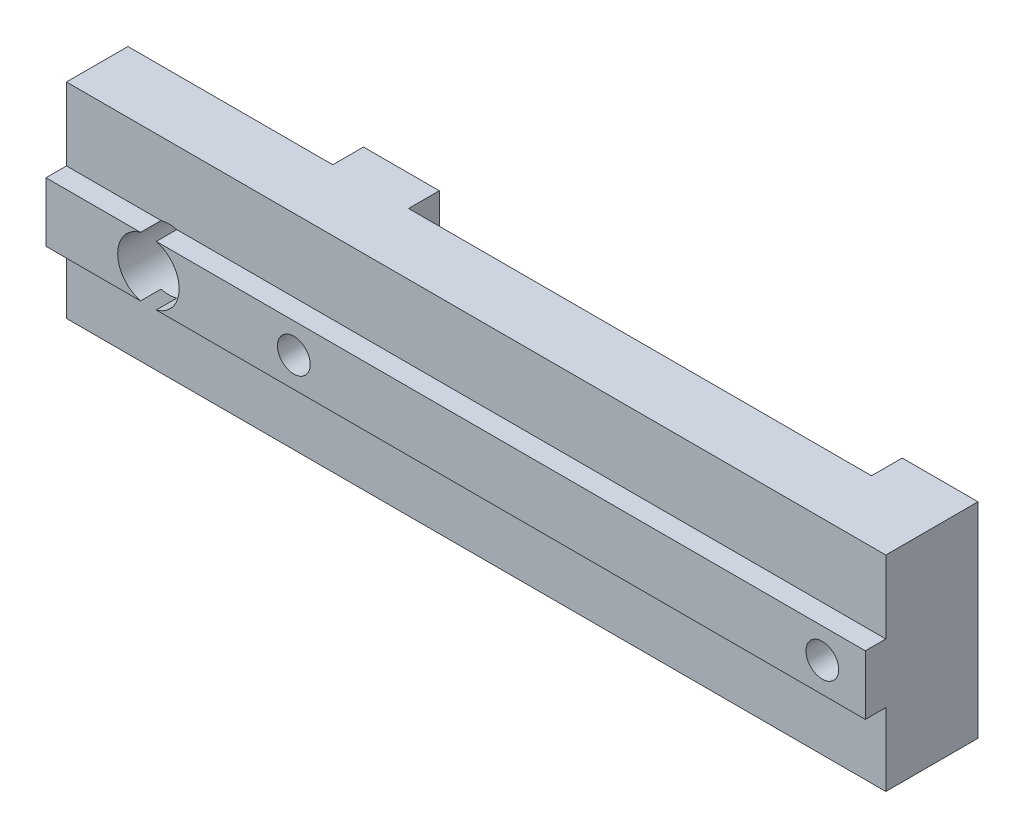
ISO-10303-21;
HEADER;
FILE_DESCRIPTION(('STEP AP214'),'2;1');
FILE_NAME('part.step','',(''),(''),'','','');
FILE_SCHEMA(('AUTOMOTIVE_DESIGN { 1 0 10303 214 1 1 1 1 }'));
ENDSEC;
DATA;
#1=APPLICATION_CONTEXT('core data for automotive mechanical design processes');
#2=APPLICATION_PROTOCOL_DEFINITION('international standard','automotive_design',2000,#1);
#3=PRODUCT_CONTEXT('',#1,'mechanical');
#4=PRODUCT('Part','Part','',(#3));
#5=PRODUCT_RELATED_PRODUCT_CATEGORY('part','',(#4));
#6=PRODUCT_DEFINITION_FORMATION('','',#4);
#7=PRODUCT_DEFINITION_CONTEXT('part definition',#1,'design');
#8=PRODUCT_DEFINITION('design','',#6,#7);
#9=PRODUCT_DEFINITION_SHAPE('','',#8);
#10=(LENGTH_UNIT() NAMED_UNIT(*) SI_UNIT(.MILLI.,.METRE.));
#11=(NAMED_UNIT(*) PLANE_ANGLE_UNIT() SI_UNIT($,.RADIAN.));
#12=(NAMED_UNIT(*) SI_UNIT($,.STERADIAN.) SOLID_ANGLE_UNIT());
#13=UNCERTAINTY_MEASURE_WITH_UNIT(LENGTH_MEASURE(1.E-05),#10,'distance_accuracy_value','');
#14=(GEOMETRIC_REPRESENTATION_CONTEXT(3) GLOBAL_UNCERTAINTY_ASSIGNED_CONTEXT((#13)) GLOBAL_UNIT_ASSIGNED_CONTEXT((#10,
#11,#12)) REPRESENTATION_CONTEXT('',''));
#15=CARTESIAN_POINT('',(0.,0.,0.));
#16=DIRECTION('',(0.,0.,1.));
#17=DIRECTION('',(1.,0.,0.));
#18=AXIS2_PLACEMENT_3D('',#15,#16,#17);
#19=CARTESIAN_POINT('',(0.,0.,0.));
#20=DIRECTION('',(0.,0.,-1.));
#21=DIRECTION('',(-1.,0.,0.));
#22=AXIS2_PLACEMENT_3D('',#19,#20,#21);
#23=PLANE('',#22);
#24=DIRECTION('',(-1.,0.,0.));
#25=VECTOR('',#24,1.);
#26=CARTESIAN_POINT('',(0.,10.,0.));
#27=LINE('',#26,#25);
#28=CARTESIAN_POINT('',(36.3,10.,0.));
#29=VERTEX_POINT('',#28);
#30=CARTESIAN_POINT('',(13.7,10.,0.));
#31=VERTEX_POINT('',#30);
#32=EDGE_CURVE('E295',#29,#31,#27,.T.);
#33=ORIENTED_EDGE('',*,*,#32,.F.);
#34=DIRECTION('',(0.,1.,0.));
#35=VECTOR('',#34,1.);
#36=CARTESIAN_POINT('',(36.3,0.,0.));
#37=LINE('',#36,#35);
#38=CARTESIAN_POINT('',(36.3,0.,0.));
#39=VERTEX_POINT('',#38);
#40=EDGE_CURVE('E187',#39,#29,#37,.T.);
#41=ORIENTED_EDGE('',*,*,#40,.F.);
#42=DIRECTION('',(1.,0.,0.));
#43=VECTOR('',#42,1.);
#44=CARTESIAN_POINT('',(0.,0.,0.));
#45=LINE('',#44,#43);
#46=CARTESIAN_POINT('',(13.7,0.,0.));
#47=VERTEX_POINT('',#46);
#48=EDGE_CURVE('E291',#47,#39,#45,.T.);
#49=ORIENTED_EDGE('',*,*,#48,.F.);
#50=DIRECTION('',(0.,-1.,0.));
#51=VECTOR('',#50,1.);
#52=CARTESIAN_POINT('',(13.7,0.,0.));
#53=LINE('',#52,#51);
#54=EDGE_CURVE('E203',#31,#47,#53,.T.);
#55=ORIENTED_EDGE('',*,*,#54,.F.);
#56=EDGE_LOOP('',(#33,#41,#49,#55));
#57=FACE_BOUND('',#56,.T.);
#58=ADVANCED_FACE('F35',(#57),#23,.T.);
#59=DIRECTION('',(0.,1.,0.));
#60=VECTOR('',#59,1.);
#61=CARTESIAN_POINT('',(10.,0.,0.));
#62=LINE('',#61,#60);
#63=CARTESIAN_POINT('',(10.,0.,0.));
#64=VERTEX_POINT('',#63);
#65=CARTESIAN_POINT('',(10.,10.,0.));
#66=VERTEX_POINT('',#65);
#67=EDGE_CURVE('E58',#64,#66,#62,.T.);
#68=ORIENTED_EDGE('',*,*,#67,.F.);
#69=CARTESIAN_POINT('',(0.,0.,0.));
#70=VERTEX_POINT('',#69);
#71=EDGE_CURVE('E292',#70,#64,#45,.T.);
#72=ORIENTED_EDGE('',*,*,#71,.F.);
#73=DIRECTION('',(0.,-1.,0.));
#74=VECTOR('',#73,1.);
#75=CARTESIAN_POINT('',(0.,0.,0.));
#76=LINE('',#75,#74);
#77=CARTESIAN_POINT('',(0.,10.,0.));
#78=VERTEX_POINT('',#77);
#79=EDGE_CURVE('E277',#78,#70,#76,.T.);
#80=ORIENTED_EDGE('',*,*,#79,.F.);
#81=EDGE_CURVE('E294',#66,#78,#27,.T.);
#82=ORIENTED_EDGE('',*,*,#81,.F.);
#83=EDGE_LOOP('',(#68,#72,#80,#82));
#84=FACE_BOUND('',#83,.T.);
#85=CARTESIAN_POINT('',(5.,5.,0.));
#86=DIRECTION('',(0.,0.,-1.));
#87=DIRECTION('',(-1.,0.,0.));
#88=AXIS2_PLACEMENT_3D('',#85,#86,#87);
#89=CIRCLE('',#88,1.5);
#90=CARTESIAN_POINT('',(3.5,5.,0.));
#91=VERTEX_POINT('',#90);
#92=EDGE_CURVE('E224',#91,#91,#89,.T.);
#93=ORIENTED_EDGE('',*,*,#92,.F.);
#94=EDGE_LOOP('',(#93));
#95=FACE_BOUND('',#94,.T.);
#96=ADVANCED_FACE('F337',(#84,#95),#23,.T.);
#97=CARTESIAN_POINT('',(40.,6.45000000000001,4.));
#98=DIRECTION('',(0.,-1.,0.));
#99=DIRECTION('',(1.,0.,0.));
#100=AXIS2_PLACEMENT_3D('',#97,#98,#99);
#101=PLANE('',#100);
#102=DIRECTION('',(-1.,0.,0.));
#103=VECTOR('',#102,1.);
#104=CARTESIAN_POINT('',(40.,6.45000000000001,4.));
#105=LINE('',#104,#103);
#106=CARTESIAN_POINT('',(4.61594271260656,6.45,4.));
#107=VERTEX_POINT('',#106);
#108=CARTESIAN_POINT('',(0.,6.45,4.));
#109=VERTEX_POINT('',#108);
#110=EDGE_CURVE('E249',#107,#109,#105,.T.);
#111=ORIENTED_EDGE('',*,*,#110,.F.);
#112=DIRECTION('',(0.,0.,-1.));
#113=VECTOR('',#112,1.);
#114=CARTESIAN_POINT('',(4.61594271260656,6.45,4.));
#115=LINE('',#114,#113);
#116=CARTESIAN_POINT('',(4.61594271260656,6.45,3.));
#117=VERTEX_POINT('',#116);
#118=EDGE_CURVE('E242',#107,#117,#115,.T.);
#119=ORIENTED_EDGE('',*,*,#118,.T.);
#120=DIRECTION('',(-1.,0.,0.));
#121=VECTOR('',#120,1.);
#122=CARTESIAN_POINT('',(40.,6.45000000000001,3.));
#123=LINE('',#122,#121);
#124=CARTESIAN_POINT('',(0.,6.45,3.));
#125=VERTEX_POINT('',#124);
#126=EDGE_CURVE('E245',#117,#125,#123,.T.);
#127=ORIENTED_EDGE('',*,*,#126,.T.);
#128=DIRECTION('',(0.,0.,-1.));
#129=VECTOR('',#128,1.);
#130=CARTESIAN_POINT('',(0.,6.45,4.));
#131=LINE('',#130,#129);
#132=EDGE_CURVE('E271',#109,#125,#131,.T.);
#133=ORIENTED_EDGE('',*,*,#132,.F.);
#134=EDGE_LOOP('',(#111,#119,#127,#133));
#135=FACE_BOUND('',#134,.T.);
#136=ADVANCED_FACE('F321',(#135),#101,.F.);
#137=CARTESIAN_POINT('',(40.,3.55000000000001,4.));
#138=DIRECTION('',(0.,1.,0.));
#139=DIRECTION('',(-1.,0.,0.));
#140=AXIS2_PLACEMENT_3D('',#137,#138,#139);
#141=PLANE('',#140);
#142=DIRECTION('',(1.,0.,0.));
#143=VECTOR('',#142,1.);
#144=CARTESIAN_POINT('',(40.,3.55000000000001,4.));
#145=LINE('',#144,#143);
#146=CARTESIAN_POINT('',(5.38405728739345,3.55,4.));
#147=VERTEX_POINT('',#146);
#148=CARTESIAN_POINT('',(40.,3.55000000000001,4.));
#149=VERTEX_POINT('',#148);
#150=EDGE_CURVE('E256',#147,#149,#145,.T.);
#151=ORIENTED_EDGE('',*,*,#150,.F.);
#152=DIRECTION('',(0.,0.,-1.));
#153=VECTOR('',#152,1.);
#154=CARTESIAN_POINT('',(5.38405728739345,3.55,4.));
#155=LINE('',#154,#153);
#156=CARTESIAN_POINT('',(5.38405728739345,3.55,3.));
#157=VERTEX_POINT('',#156);
#158=EDGE_CURVE('E233',#147,#157,#155,.T.);
#159=ORIENTED_EDGE('',*,*,#158,.T.);
#160=DIRECTION('',(1.,0.,0.));
#161=VECTOR('',#160,1.);
#162=CARTESIAN_POINT('',(40.,3.55000000000001,3.));
#163=LINE('',#162,#161);
#164=CARTESIAN_POINT('',(40.,3.55,3.));
#165=VERTEX_POINT('',#164);
#166=EDGE_CURVE('E264',#157,#165,#163,.T.);
#167=ORIENTED_EDGE('',*,*,#166,.T.);
#168=DIRECTION('',(0.,0.,-1.));
#169=VECTOR('',#168,1.);
#170=CARTESIAN_POINT('',(40.,3.55000000000001,4.));
#171=LINE('',#170,#169);
#172=EDGE_CURVE('E260',#149,#165,#171,.T.);
#173=ORIENTED_EDGE('',*,*,#172,.F.);
#174=EDGE_LOOP('',(#151,#159,#167,#173));
#175=FACE_BOUND('',#174,.T.);
#176=ADVANCED_FACE('F377',(#175),#141,.F.);
#177=CARTESIAN_POINT('',(0.,0.,4.));
#178=DIRECTION('',(0.,0.,1.));
#179=DIRECTION('',(1.,0.,0.));
#180=AXIS2_PLACEMENT_3D('',#177,#178,#179);
#181=PLANE('',#180);
#182=CARTESIAN_POINT('',(5.,5.,4.));
#183=DIRECTION('',(0.,0.,1.));
#184=DIRECTION('',(1.,0.,0.));
#185=AXIS2_PLACEMENT_3D('',#182,#183,#184);
#186=CIRCLE('',#185,1.5);
#187=CARTESIAN_POINT('',(4.61594271260655,3.55,4.));
#188=VERTEX_POINT('',#187);
#189=EDGE_CURVE('E11',#107,#188,#186,.T.);
#190=ORIENTED_EDGE('',*,*,#189,.F.);
#191=ORIENTED_EDGE('',*,*,#110,.T.);
#192=DIRECTION('',(0.,-1.,0.));
#193=VECTOR('',#192,1.);
#194=CARTESIAN_POINT('',(0.,3.55,4.));
#195=LINE('',#194,#193);
#196=CARTESIAN_POINT('',(0.,3.55,4.));
#197=VERTEX_POINT('',#196);
#198=EDGE_CURVE('E254',#109,#197,#195,.T.);
#199=ORIENTED_EDGE('',*,*,#198,.T.);
#200=EDGE_CURVE('E257',#197,#188,#145,.T.);
#201=ORIENTED_EDGE('',*,*,#200,.T.);
#202=EDGE_LOOP('',(#190,#191,#199,#201));
#203=FACE_BOUND('',#202,.T.);
#204=ADVANCED_FACE('F325',(#203),#181,.T.);
#205=CARTESIAN_POINT('',(0.,0.,3.));
#206=DIRECTION('',(0.,0.,-1.));
#207=DIRECTION('',(-1.,0.,0.));
#208=AXIS2_PLACEMENT_3D('',#205,#206,#207);
#209=PLANE('',#208);
#210=ORIENTED_EDGE('',*,*,#166,.F.);
#211=CARTESIAN_POINT('',(5.,5.,3.));
#212=DIRECTION('',(0.,0.,-1.));
#213=DIRECTION('',(-1.,0.,0.));
#214=AXIS2_PLACEMENT_3D('',#211,#212,#213);
#215=CIRCLE('',#214,1.5);
#216=CARTESIAN_POINT('',(4.61594271260655,3.55,3.));
#217=VERTEX_POINT('',#216);
#218=EDGE_CURVE('E230',#157,#217,#215,.T.);
#219=ORIENTED_EDGE('',*,*,#218,.T.);
#220=CARTESIAN_POINT('',(0.,3.55,3.));
#221=VERTEX_POINT('',#220);
#222=EDGE_CURVE('E250',#221,#217,#163,.T.);
#223=ORIENTED_EDGE('',*,*,#222,.F.);
#224=DIRECTION('',(0.,-1.,0.));
#225=VECTOR('',#224,1.);
#226=CARTESIAN_POINT('',(0.,0.,3.));
#227=LINE('',#226,#225);
#228=CARTESIAN_POINT('',(0.,0.,3.));
#229=VERTEX_POINT('',#228);
#230=EDGE_CURVE('E282',#221,#229,#227,.T.);
#231=ORIENTED_EDGE('',*,*,#230,.T.);
#232=DIRECTION('',(1.,0.,0.));
#233=VECTOR('',#232,1.);
#234=CARTESIAN_POINT('',(0.,0.,3.));
#235=LINE('',#234,#233);
#236=CARTESIAN_POINT('',(40.,0.,3.));
#237=VERTEX_POINT('',#236);
#238=EDGE_CURVE('E281',#229,#237,#235,.T.);
#239=ORIENTED_EDGE('',*,*,#238,.T.);
#240=DIRECTION('',(0.,1.,0.));
#241=VECTOR('',#240,1.);
#242=CARTESIAN_POINT('',(40.,0.,3.));
#243=LINE('',#242,#241);
#244=EDGE_CURVE('E169',#237,#165,#243,.T.);
#245=ORIENTED_EDGE('',*,*,#244,.T.);
#246=EDGE_LOOP('',(#210,#219,#223,#231,#239,#245));
#247=FACE_BOUND('',#246,.T.);
#248=ADVANCED_FACE('F333',(#247),#209,.F.);
#249=ORIENTED_EDGE('',*,*,#126,.F.);
#250=CARTESIAN_POINT('',(5.,5.,3.));
#251=DIRECTION('',(0.,0.,-1.));
#252=DIRECTION('',(-1.,0.,0.));
#253=AXIS2_PLACEMENT_3D('',#250,#251,#252);
#254=CIRCLE('',#253,1.5);
#255=CARTESIAN_POINT('',(5.38405728739344,6.45,3.));
#256=VERTEX_POINT('',#255);
#257=EDGE_CURVE('E239',#117,#256,#254,.T.);
#258=ORIENTED_EDGE('',*,*,#257,.T.);
#259=CARTESIAN_POINT('',(40.,6.45,3.));
#260=VERTEX_POINT('',#259);
#261=EDGE_CURVE('E261',#260,#256,#123,.T.);
#262=ORIENTED_EDGE('',*,*,#261,.F.);
#263=CARTESIAN_POINT('',(40.,10.,3.));
#264=VERTEX_POINT('',#263);
#265=EDGE_CURVE('E284',#260,#264,#243,.T.);
#266=ORIENTED_EDGE('',*,*,#265,.T.);
#267=DIRECTION('',(-1.,0.,0.));
#268=VECTOR('',#267,1.);
#269=CARTESIAN_POINT('',(0.,10.,3.));
#270=LINE('',#269,#268);
#271=CARTESIAN_POINT('',(0.,10.,3.));
#272=VERTEX_POINT('',#271);
#273=EDGE_CURVE('E286',#264,#272,#270,.T.);
#274=ORIENTED_EDGE('',*,*,#273,.T.);
#275=EDGE_CURVE('E278',#272,#125,#227,.T.);
#276=ORIENTED_EDGE('',*,*,#275,.T.);
#277=EDGE_LOOP('',(#249,#258,#262,#266,#274,#276));
#278=FACE_BOUND('',#277,.T.);
#279=ADVANCED_FACE('F316',(#278),#209,.F.);
#280=CARTESIAN_POINT('',(0.,0.,3.));
#281=DIRECTION('',(1.,0.,0.));
#282=DIRECTION('',(0.,0.,-1.));
#283=AXIS2_PLACEMENT_3D('',#280,#281,#282);
#284=PLANE('',#283);
#285=ORIENTED_EDGE('',*,*,#79,.T.);
#286=DIRECTION('',(0.,0.,-1.));
#287=VECTOR('',#286,1.);
#288=CARTESIAN_POINT('',(0.,0.,3.));
#289=LINE('',#288,#287);
#290=EDGE_CURVE('E172',#229,#70,#289,.T.);
#291=ORIENTED_EDGE('',*,*,#290,.F.);
#292=ORIENTED_EDGE('',*,*,#230,.F.);
#293=DIRECTION('',(0.,0.,-1.));
#294=VECTOR('',#293,1.);
#295=CARTESIAN_POINT('',(0.,3.55,4.));
#296=LINE('',#295,#294);
#297=EDGE_CURVE('E268',#197,#221,#296,.T.);
#298=ORIENTED_EDGE('',*,*,#297,.F.);
#299=ORIENTED_EDGE('',*,*,#198,.F.);
#300=ORIENTED_EDGE('',*,*,#132,.T.);
#301=ORIENTED_EDGE('',*,*,#275,.F.);
#302=DIRECTION('',(0.,0.,-1.));
#303=VECTOR('',#302,1.);
#304=CARTESIAN_POINT('',(0.,10.,3.));
#305=LINE('',#304,#303);
#306=EDGE_CURVE('E288',#272,#78,#305,.T.);
#307=ORIENTED_EDGE('',*,*,#306,.T.);
#308=EDGE_LOOP('',(#285,#291,#292,#298,#299,#300,#301,#307));
#309=FACE_BOUND('',#308,.T.);
#310=ADVANCED_FACE('F37',(#309),#284,.F.);
#311=CARTESIAN_POINT('',(0.,0.,3.));
#312=DIRECTION('',(0.,1.,0.));
#313=DIRECTION('',(0.,0.,1.));
#314=AXIS2_PLACEMENT_3D('',#311,#312,#313);
#315=PLANE('',#314);
#316=ORIENTED_EDGE('',*,*,#71,.T.);
#317=DIRECTION('',(0.,0.,1.));
#318=VECTOR('',#317,1.);
#319=CARTESIAN_POINT('',(10.,0.,-1.5));
#320=LINE('',#319,#318);
#321=CARTESIAN_POINT('',(10.,0.,-1.5));
#322=VERTEX_POINT('',#321);
#323=EDGE_CURVE('E209',#322,#64,#320,.T.);
#324=ORIENTED_EDGE('',*,*,#323,.F.);
#325=DIRECTION('',(-1.,0.,0.));
#326=VECTOR('',#325,1.);
#327=CARTESIAN_POINT('',(10.,0.,-1.5));
#328=LINE('',#327,#326);
#329=CARTESIAN_POINT('',(13.7,0.,-1.5));
#330=VERTEX_POINT('',#329);
#331=EDGE_CURVE('E207',#330,#322,#328,.T.);
#332=ORIENTED_EDGE('',*,*,#331,.F.);
#333=DIRECTION('',(0.,0.,1.));
#334=VECTOR('',#333,1.);
#335=CARTESIAN_POINT('',(13.7,0.,-1.5));
#336=LINE('',#335,#334);
#337=EDGE_CURVE('E215',#330,#47,#336,.T.);
#338=ORIENTED_EDGE('',*,*,#337,.T.);
#339=ORIENTED_EDGE('',*,*,#48,.T.);
#340=DIRECTION('',(0.,0.,1.));
#341=VECTOR('',#340,1.);
#342=CARTESIAN_POINT('',(36.3,0.,-1.5));
#343=LINE('',#342,#341);
#344=CARTESIAN_POINT('',(36.3,0.,-1.5));
#345=VERTEX_POINT('',#344);
#346=EDGE_CURVE('E179',#345,#39,#343,.T.);
#347=ORIENTED_EDGE('',*,*,#346,.F.);
#348=DIRECTION('',(-1.,0.,0.));
#349=VECTOR('',#348,1.);
#350=CARTESIAN_POINT('',(40.,0.,-1.5));
#351=LINE('',#350,#349);
#352=CARTESIAN_POINT('',(40.,0.,-1.5));
#353=VERTEX_POINT('',#352);
#354=EDGE_CURVE('E176',#353,#345,#351,.T.);
#355=ORIENTED_EDGE('',*,*,#354,.F.);
#356=DIRECTION('',(0.,0.,-1.));
#357=VECTOR('',#356,1.);
#358=CARTESIAN_POINT('',(40.,0.,3.));
#359=LINE('',#358,#357);
#360=EDGE_CURVE('E161',#237,#353,#359,.T.);
#361=ORIENTED_EDGE('',*,*,#360,.F.);
#362=ORIENTED_EDGE('',*,*,#238,.F.);
#363=ORIENTED_EDGE('',*,*,#290,.T.);
#364=EDGE_LOOP('',(#316,#324,#332,#338,#339,#347,#355,#361,#362,#363));
#365=FACE_BOUND('',#364,.T.);
#366=ADVANCED_FACE('F177',(#365),#315,.F.);
#367=CARTESIAN_POINT('',(40.,0.,3.));
#368=DIRECTION('',(-1.,0.,0.));
#369=DIRECTION('',(0.,0.,1.));
#370=AXIS2_PLACEMENT_3D('',#367,#368,#369);
#371=PLANE('',#370);
#372=ORIENTED_EDGE('',*,*,#360,.T.);
#373=DIRECTION('',(0.,-1.,0.));
#374=VECTOR('',#373,1.);
#375=CARTESIAN_POINT('',(40.,0.,-1.5));
#376=LINE('',#375,#374);
#377=CARTESIAN_POINT('',(40.,10.,-1.5));
#378=VERTEX_POINT('',#377);
#379=EDGE_CURVE('E166',#378,#353,#376,.T.);
#380=ORIENTED_EDGE('',*,*,#379,.F.);
#381=DIRECTION('',(0.,0.,-1.));
#382=VECTOR('',#381,1.);
#383=CARTESIAN_POINT('',(40.,10.,3.));
#384=LINE('',#383,#382);
#385=EDGE_CURVE('E173',#264,#378,#384,.T.);
#386=ORIENTED_EDGE('',*,*,#385,.F.);
#387=ORIENTED_EDGE('',*,*,#265,.F.);
#388=DIRECTION('',(0.,0.,-1.));
#389=VECTOR('',#388,1.);
#390=CARTESIAN_POINT('',(40.,6.45000000000001,4.));
#391=LINE('',#390,#389);
#392=CARTESIAN_POINT('',(40.,6.45000000000001,4.));
#393=VERTEX_POINT('',#392);
#394=EDGE_CURVE('E274',#393,#260,#391,.T.);
#395=ORIENTED_EDGE('',*,*,#394,.F.);
#396=DIRECTION('',(0.,1.,0.));
#397=VECTOR('',#396,1.);
#398=CARTESIAN_POINT('',(40.,3.55000000000001,4.));
#399=LINE('',#398,#397);
#400=EDGE_CURVE('E246',#149,#393,#399,.T.);
#401=ORIENTED_EDGE('',*,*,#400,.F.);
#402=ORIENTED_EDGE('',*,*,#172,.T.);
#403=ORIENTED_EDGE('',*,*,#244,.F.);
#404=EDGE_LOOP('',(#372,#380,#386,#387,#395,#401,#402,#403));
#405=FACE_BOUND('',#404,.T.);
#406=ADVANCED_FACE('F163',(#405),#371,.F.);
#407=CARTESIAN_POINT('',(0.,10.,3.));
#408=DIRECTION('',(0.,-1.,0.));
#409=DIRECTION('',(0.,0.,-1.));
#410=AXIS2_PLACEMENT_3D('',#407,#408,#409);
#411=PLANE('',#410);
#412=ORIENTED_EDGE('',*,*,#385,.T.);
#413=DIRECTION('',(1.,0.,0.));
#414=VECTOR('',#413,1.);
#415=CARTESIAN_POINT('',(40.,10.,-1.5));
#416=LINE('',#415,#414);
#417=CARTESIAN_POINT('',(36.3,10.,-1.5));
#418=VERTEX_POINT('',#417);
#419=EDGE_CURVE('E186',#418,#378,#416,.T.);
#420=ORIENTED_EDGE('',*,*,#419,.F.);
#421=DIRECTION('',(0.,0.,1.));
#422=VECTOR('',#421,1.);
#423=CARTESIAN_POINT('',(36.3,10.,-1.5));
#424=LINE('',#423,#422);
#425=EDGE_CURVE('E50',#418,#29,#424,.T.);
#426=ORIENTED_EDGE('',*,*,#425,.T.);
#427=ORIENTED_EDGE('',*,*,#32,.T.);
#428=DIRECTION('',(0.,0.,1.));
#429=VECTOR('',#428,1.);
#430=CARTESIAN_POINT('',(13.7,10.,-1.5));
#431=LINE('',#430,#429);
#432=CARTESIAN_POINT('',(13.7,10.,-1.5));
#433=VERTEX_POINT('',#432);
#434=EDGE_CURVE('E218',#433,#31,#431,.T.);
#435=ORIENTED_EDGE('',*,*,#434,.F.);
#436=DIRECTION('',(1.,0.,0.));
#437=VECTOR('',#436,1.);
#438=CARTESIAN_POINT('',(10.,10.,-1.5));
#439=LINE('',#438,#437);
#440=CARTESIAN_POINT('',(10.,10.,-1.5));
#441=VERTEX_POINT('',#440);
#442=EDGE_CURVE('E202',#441,#433,#439,.T.);
#443=ORIENTED_EDGE('',*,*,#442,.F.);
#444=DIRECTION('',(0.,0.,1.));
#445=VECTOR('',#444,1.);
#446=CARTESIAN_POINT('',(10.,10.,-1.5));
#447=LINE('',#446,#445);
#448=EDGE_CURVE('E221',#441,#66,#447,.T.);
#449=ORIENTED_EDGE('',*,*,#448,.T.);
#450=ORIENTED_EDGE('',*,*,#81,.T.);
#451=ORIENTED_EDGE('',*,*,#306,.F.);
#452=ORIENTED_EDGE('',*,*,#273,.F.);
#453=EDGE_LOOP('',(#412,#420,#426,#427,#435,#443,#449,#450,#451,#452));
#454=FACE_BOUND('',#453,.T.);
#455=ADVANCED_FACE('F358',(#454),#411,.F.);
#456=ORIENTED_EDGE('',*,*,#261,.T.);
#457=DIRECTION('',(0.,0.,-1.));
#458=VECTOR('',#457,1.);
#459=CARTESIAN_POINT('',(5.38405728739344,6.45,4.));
#460=LINE('',#459,#458);
#461=CARTESIAN_POINT('',(5.38405728739344,6.45,4.));
#462=VERTEX_POINT('',#461);
#463=EDGE_CURVE('E236',#256,#462,#460,.F.);
#464=ORIENTED_EDGE('',*,*,#463,.T.);
#465=EDGE_CURVE('E251',#393,#462,#105,.T.);
#466=ORIENTED_EDGE('',*,*,#465,.F.);
#467=ORIENTED_EDGE('',*,*,#394,.T.);
#468=EDGE_LOOP('',(#456,#464,#466,#467));
#469=FACE_BOUND('',#468,.T.);
#470=ADVANCED_FACE('F307',(#469),#101,.F.);
#471=ORIENTED_EDGE('',*,*,#222,.T.);
#472=DIRECTION('',(0.,0.,-1.));
#473=VECTOR('',#472,1.);
#474=CARTESIAN_POINT('',(4.61594271260655,3.55,4.));
#475=LINE('',#474,#473);
#476=EDGE_CURVE('E227',#217,#188,#475,.F.);
#477=ORIENTED_EDGE('',*,*,#476,.T.);
#478=ORIENTED_EDGE('',*,*,#200,.F.);
#479=ORIENTED_EDGE('',*,*,#297,.T.);
#480=EDGE_LOOP('',(#471,#477,#478,#479));
#481=FACE_BOUND('',#480,.T.);
#482=ADVANCED_FACE('F329',(#481),#141,.F.);
#483=CARTESIAN_POINT('',(12.1,5.,4.));
#484=DIRECTION('',(0.,0.,-1.));
#485=DIRECTION('',(-1.,0.,0.));
#486=AXIS2_PLACEMENT_3D('',#483,#484,#485);
#487=CIRCLE('',#486,0.800000000000001);
#488=CARTESIAN_POINT('',(11.3,5.,4.));
#489=VERTEX_POINT('',#488);
#490=EDGE_CURVE('E408',#489,#489,#487,.T.);
#491=ORIENTED_EDGE('',*,*,#490,.T.);
#492=EDGE_LOOP('',(#491));
#493=FACE_BOUND('',#492,.T.);
#494=CARTESIAN_POINT('',(37.9,5.,4.));
#495=DIRECTION('',(0.,0.,-1.));
#496=DIRECTION('',(-1.,0.,0.));
#497=AXIS2_PLACEMENT_3D('',#494,#495,#496);
#498=CIRCLE('',#497,0.800000000000002);
#499=CARTESIAN_POINT('',(37.1,5.,4.));
#500=VERTEX_POINT('',#499);
#501=EDGE_CURVE('E189',#500,#500,#498,.T.);
#502=ORIENTED_EDGE('',*,*,#501,.T.);
#503=EDGE_LOOP('',(#502));
#504=FACE_BOUND('',#503,.T.);
#505=EDGE_CURVE('E39',#147,#462,#186,.T.);
#506=ORIENTED_EDGE('',*,*,#505,.F.);
#507=ORIENTED_EDGE('',*,*,#150,.T.);
#508=ORIENTED_EDGE('',*,*,#400,.T.);
#509=ORIENTED_EDGE('',*,*,#465,.T.);
#510=EDGE_LOOP('',(#506,#507,#508,#509));
#511=FACE_BOUND('',#510,.T.);
#512=ADVANCED_FACE('F308',(#493,#504,#511),#181,.T.);
#513=CARTESIAN_POINT('',(5.,5.,4.));
#514=DIRECTION('',(0.,0.,-1.));
#515=DIRECTION('',(-1.,0.,0.));
#516=AXIS2_PLACEMENT_3D('',#513,#514,#515);
#517=CYLINDRICAL_SURFACE('',#516,1.5);
#518=ORIENTED_EDGE('',*,*,#92,.T.);
#519=EDGE_LOOP('',(#518));
#520=FACE_BOUND('',#519,.T.);
#521=ORIENTED_EDGE('',*,*,#189,.T.);
#522=ORIENTED_EDGE('',*,*,#476,.F.);
#523=ORIENTED_EDGE('',*,*,#218,.F.);
#524=ORIENTED_EDGE('',*,*,#158,.F.);
#525=ORIENTED_EDGE('',*,*,#505,.T.);
#526=ORIENTED_EDGE('',*,*,#463,.F.);
#527=ORIENTED_EDGE('',*,*,#257,.F.);
#528=ORIENTED_EDGE('',*,*,#118,.F.);
#529=EDGE_LOOP('',(#521,#522,#523,#524,#525,#526,#527,#528));
#530=FACE_BOUND('',#529,.T.);
#531=ADVANCED_FACE('F303',(#520,#530),#517,.F.);
#532=CARTESIAN_POINT('',(10.,0.,-1.5));
#533=DIRECTION('',(1.,0.,0.));
#534=DIRECTION('',(0.,0.,-1.));
#535=AXIS2_PLACEMENT_3D('',#532,#533,#534);
#536=PLANE('',#535);
#537=ORIENTED_EDGE('',*,*,#67,.T.);
#538=ORIENTED_EDGE('',*,*,#448,.F.);
#539=DIRECTION('',(0.,1.,0.));
#540=VECTOR('',#539,1.);
#541=CARTESIAN_POINT('',(10.,0.,-1.5));
#542=LINE('',#541,#540);
#543=EDGE_CURVE('E199',#322,#441,#542,.T.);
#544=ORIENTED_EDGE('',*,*,#543,.F.);
#545=ORIENTED_EDGE('',*,*,#323,.T.);
#546=EDGE_LOOP('',(#537,#538,#544,#545));
#547=FACE_BOUND('',#546,.T.);
#548=ADVANCED_FACE('F343',(#547),#536,.F.);
#549=CARTESIAN_POINT('',(13.7,0.,-1.5));
#550=DIRECTION('',(-1.,0.,0.));
#551=DIRECTION('',(0.,-1.,0.));
#552=AXIS2_PLACEMENT_3D('',#549,#550,#551);
#553=PLANE('',#552);
#554=ORIENTED_EDGE('',*,*,#54,.T.);
#555=ORIENTED_EDGE('',*,*,#337,.F.);
#556=DIRECTION('',(0.,-1.,0.));
#557=VECTOR('',#556,1.);
#558=CARTESIAN_POINT('',(13.7,0.,-1.5));
#559=LINE('',#558,#557);
#560=EDGE_CURVE('E205',#433,#330,#559,.T.);
#561=ORIENTED_EDGE('',*,*,#560,.F.);
#562=ORIENTED_EDGE('',*,*,#434,.T.);
#563=EDGE_LOOP('',(#554,#555,#561,#562));
#564=FACE_BOUND('',#563,.T.);
#565=ADVANCED_FACE('F351',(#564),#553,.F.);
#566=CARTESIAN_POINT('',(0.,0.,-1.5));
#567=DIRECTION('',(0.,0.,-1.));
#568=DIRECTION('',(-1.,0.,0.));
#569=AXIS2_PLACEMENT_3D('',#566,#567,#568);
#570=PLANE('',#569);
#571=CARTESIAN_POINT('',(12.1,5.,-1.5));
#572=DIRECTION('',(0.,0.,-1.));
#573=DIRECTION('',(-1.,0.,0.));
#574=AXIS2_PLACEMENT_3D('',#571,#572,#573);
#575=CIRCLE('',#574,0.800000000000001);
#576=CARTESIAN_POINT('',(11.3,5.,-1.5));
#577=VERTEX_POINT('',#576);
#578=EDGE_CURVE('E411',#577,#577,#575,.T.);
#579=ORIENTED_EDGE('',*,*,#578,.F.);
#580=EDGE_LOOP('',(#579));
#581=FACE_BOUND('',#580,.T.);
#582=ORIENTED_EDGE('',*,*,#543,.T.);
#583=ORIENTED_EDGE('',*,*,#442,.T.);
#584=ORIENTED_EDGE('',*,*,#560,.T.);
#585=ORIENTED_EDGE('',*,*,#331,.T.);
#586=EDGE_LOOP('',(#582,#583,#584,#585));
#587=FACE_BOUND('',#586,.T.);
#588=ADVANCED_FACE('F346',(#581,#587),#570,.T.);
#589=CARTESIAN_POINT('',(36.3,0.,-1.5));
#590=DIRECTION('',(1.,0.,0.));
#591=DIRECTION('',(0.,0.,-1.));
#592=AXIS2_PLACEMENT_3D('',#589,#590,#591);
#593=PLANE('',#592);
#594=ORIENTED_EDGE('',*,*,#40,.T.);
#595=ORIENTED_EDGE('',*,*,#425,.F.);
#596=DIRECTION('',(0.,1.,0.));
#597=VECTOR('',#596,1.);
#598=CARTESIAN_POINT('',(36.3,0.,-1.5));
#599=LINE('',#598,#597);
#600=EDGE_CURVE('E182',#345,#418,#599,.T.);
#601=ORIENTED_EDGE('',*,*,#600,.F.);
#602=ORIENTED_EDGE('',*,*,#346,.T.);
#603=EDGE_LOOP('',(#594,#595,#601,#602));
#604=FACE_BOUND('',#603,.T.);
#605=ADVANCED_FACE('F357',(#604),#593,.F.);
#606=CARTESIAN_POINT('',(0.,0.,-1.5));
#607=DIRECTION('',(0.,0.,1.));
#608=DIRECTION('',(1.,0.,0.));
#609=AXIS2_PLACEMENT_3D('',#606,#607,#608);
#610=PLANE('',#609);
#611=CARTESIAN_POINT('',(37.9,5.,-1.5));
#612=DIRECTION('',(0.,0.,-1.));
#613=DIRECTION('',(-1.,0.,0.));
#614=AXIS2_PLACEMENT_3D('',#611,#612,#613);
#615=CIRCLE('',#614,0.800000000000002);
#616=CARTESIAN_POINT('',(37.1,5.,-1.5));
#617=VERTEX_POINT('',#616);
#618=EDGE_CURVE('E192',#617,#617,#615,.T.);
#619=ORIENTED_EDGE('',*,*,#618,.F.);
#620=EDGE_LOOP('',(#619));
#621=FACE_BOUND('',#620,.T.);
#622=ORIENTED_EDGE('',*,*,#379,.T.);
#623=ORIENTED_EDGE('',*,*,#354,.T.);
#624=ORIENTED_EDGE('',*,*,#600,.T.);
#625=ORIENTED_EDGE('',*,*,#419,.T.);
#626=EDGE_LOOP('',(#622,#623,#624,#625));
#627=FACE_BOUND('',#626,.T.);
#628=ADVANCED_FACE('F185',(#621,#627),#610,.F.);
#629=CARTESIAN_POINT('',(37.9,5.,4.));
#630=DIRECTION('',(0.,0.,-1.));
#631=DIRECTION('',(-1.,0.,0.));
#632=AXIS2_PLACEMENT_3D('',#629,#630,#631);
#633=CYLINDRICAL_SURFACE('',#632,0.800000000000002);
#634=ORIENTED_EDGE('',*,*,#501,.F.);
#635=EDGE_LOOP('',(#634));
#636=FACE_BOUND('',#635,.T.);
#637=ORIENTED_EDGE('',*,*,#618,.T.);
#638=EDGE_LOOP('',(#637));
#639=FACE_BOUND('',#638,.T.);
#640=ADVANCED_FACE('F395',(#636,#639),#633,.F.);
#641=CARTESIAN_POINT('',(12.1,5.,4.));
#642=DIRECTION('',(0.,0.,-1.));
#643=DIRECTION('',(-1.,0.,0.));
#644=AXIS2_PLACEMENT_3D('',#641,#642,#643);
#645=CYLINDRICAL_SURFACE('',#644,0.800000000000001);
#646=ORIENTED_EDGE('',*,*,#490,.F.);
#647=EDGE_LOOP('',(#646));
#648=FACE_BOUND('',#647,.T.);
#649=ORIENTED_EDGE('',*,*,#578,.T.);
#650=EDGE_LOOP('',(#649));
#651=FACE_BOUND('',#650,.T.);
#652=ADVANCED_FACE('F399',(#648,#651),#645,.F.);
#653=CLOSED_SHELL('',(#58,#96,#136,#176,#204,#248,#279,#310,#366,#406,#455,#470,#482,#512,#531,
#548,#565,#588,#605,#628,#640,#652));
#654=MANIFOLD_SOLID_BREP('B2',#653);
#655=ADVANCED_BREP_SHAPE_REPRESENTATION('',(#18,#654),#14);
#656=SHAPE_DEFINITION_REPRESENTATION(#9,#655);
ENDSEC;
END-ISO-10303-21;
